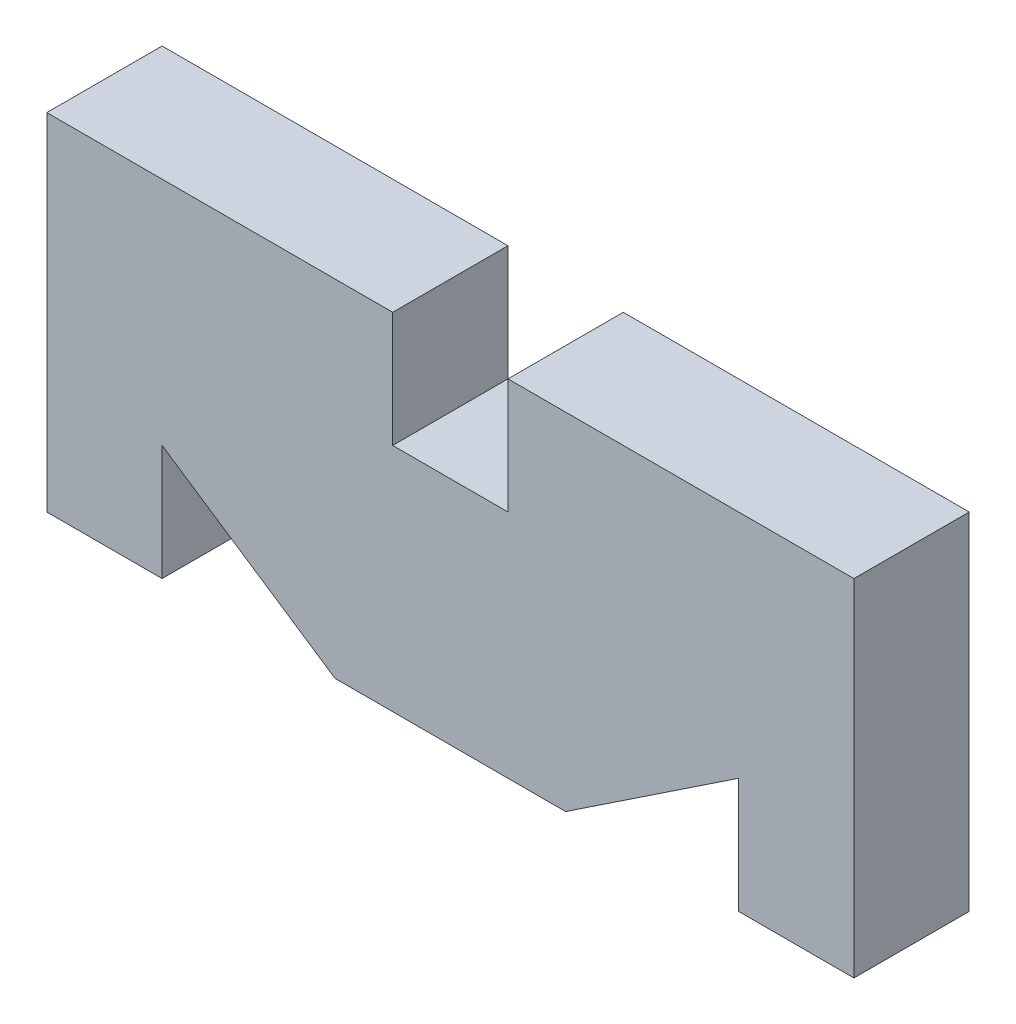
ISO-10303-21;
HEADER;
FILE_DESCRIPTION(('STEP AP214'),'2;1');
FILE_NAME('part.step','',(''),(''),'','','');
FILE_SCHEMA(('AUTOMOTIVE_DESIGN { 1 0 10303 214 1 1 1 1 }'));
ENDSEC;
DATA;
#1=APPLICATION_CONTEXT('core data for automotive mechanical design processes');
#2=APPLICATION_PROTOCOL_DEFINITION('international standard','automotive_design',2000,#1);
#3=PRODUCT_CONTEXT('',#1,'mechanical');
#4=PRODUCT('Part','Part','',(#3));
#5=PRODUCT_RELATED_PRODUCT_CATEGORY('part','',(#4));
#6=PRODUCT_DEFINITION_FORMATION('','',#4);
#7=PRODUCT_DEFINITION_CONTEXT('part definition',#1,'design');
#8=PRODUCT_DEFINITION('design','',#6,#7);
#9=PRODUCT_DEFINITION_SHAPE('','',#8);
#10=(LENGTH_UNIT() NAMED_UNIT(*) SI_UNIT(.MILLI.,.METRE.));
#11=(NAMED_UNIT(*) PLANE_ANGLE_UNIT() SI_UNIT($,.RADIAN.));
#12=(NAMED_UNIT(*) SI_UNIT($,.STERADIAN.) SOLID_ANGLE_UNIT());
#13=UNCERTAINTY_MEASURE_WITH_UNIT(LENGTH_MEASURE(1.E-05),#10,'distance_accuracy_value','');
#14=(GEOMETRIC_REPRESENTATION_CONTEXT(3) GLOBAL_UNCERTAINTY_ASSIGNED_CONTEXT((#13)) GLOBAL_UNIT_ASSIGNED_CONTEXT((#10,
#11,#12)) REPRESENTATION_CONTEXT('',''));
#15=CARTESIAN_POINT('',(0.,0.,0.));
#16=DIRECTION('',(0.,0.,1.));
#17=DIRECTION('',(1.,0.,0.));
#18=AXIS2_PLACEMENT_3D('',#15,#16,#17);
#19=CARTESIAN_POINT('',(0.,15.,10.));
#20=DIRECTION('',(0.,1.,0.));
#21=DIRECTION('',(0.,0.,1.));
#22=AXIS2_PLACEMENT_3D('',#19,#20,#21);
#23=PLANE('',#22);
#24=DIRECTION('',(1.,0.,0.));
#25=VECTOR('',#24,1.);
#26=CARTESIAN_POINT('',(0.,15.,0.));
#27=LINE('',#26,#25);
#28=CARTESIAN_POINT('',(5.,15.,0.));
#29=VERTEX_POINT('',#28);
#30=CARTESIAN_POINT('',(35.,15.,0.));
#31=VERTEX_POINT('',#30);
#32=EDGE_CURVE('E176',#29,#31,#27,.T.);
#33=ORIENTED_EDGE('',*,*,#32,.F.);
#34=DIRECTION('',(0.,0.,-1.));
#35=VECTOR('',#34,1.);
#36=CARTESIAN_POINT('',(5.,15.,10.));
#37=LINE('',#36,#35);
#38=CARTESIAN_POINT('',(5.,15.,10.));
#39=VERTEX_POINT('',#38);
#40=EDGE_CURVE('E11',#39,#29,#37,.T.);
#41=ORIENTED_EDGE('',*,*,#40,.F.);
#42=DIRECTION('',(1.,0.,0.));
#43=VECTOR('',#42,1.);
#44=CARTESIAN_POINT('',(0.,15.,10.));
#45=LINE('',#44,#43);
#46=CARTESIAN_POINT('',(35.,15.,10.));
#47=VERTEX_POINT('',#46);
#48=EDGE_CURVE('E226',#39,#47,#45,.T.);
#49=ORIENTED_EDGE('',*,*,#48,.T.);
#50=DIRECTION('',(0.,0.,-1.));
#51=VECTOR('',#50,1.);
#52=CARTESIAN_POINT('',(35.,15.,10.));
#53=LINE('',#52,#51);
#54=EDGE_CURVE('E113',#47,#31,#53,.T.);
#55=ORIENTED_EDGE('',*,*,#54,.T.);
#56=EDGE_LOOP('',(#33,#41,#49,#55));
#57=FACE_BOUND('',#56,.T.);
#58=ADVANCED_FACE('F43',(#57),#23,.T.);
#59=CARTESIAN_POINT('',(5.,0.,10.));
#60=DIRECTION('',(1.,0.,0.));
#61=DIRECTION('',(0.,1.,0.));
#62=AXIS2_PLACEMENT_3D('',#59,#60,#61);
#63=PLANE('',#62);
#64=DIRECTION('',(0.,-1.,0.));
#65=VECTOR('',#64,1.);
#66=CARTESIAN_POINT('',(5.,0.,0.));
#67=LINE('',#66,#65);
#68=CARTESIAN_POINT('',(5.,5.,0.));
#69=VERTEX_POINT('',#68);
#70=EDGE_CURVE('E180',#29,#69,#67,.T.);
#71=ORIENTED_EDGE('',*,*,#70,.T.);
#72=DIRECTION('',(0.,0.,-1.));
#73=VECTOR('',#72,1.);
#74=CARTESIAN_POINT('',(5.,5.,10.));
#75=LINE('',#74,#73);
#76=CARTESIAN_POINT('',(5.,5.,10.));
#77=VERTEX_POINT('',#76);
#78=EDGE_CURVE('E52',#77,#69,#75,.T.);
#79=ORIENTED_EDGE('',*,*,#78,.F.);
#80=DIRECTION('',(0.,-1.,0.));
#81=VECTOR('',#80,1.);
#82=CARTESIAN_POINT('',(5.,0.,10.));
#83=LINE('',#82,#81);
#84=EDGE_CURVE('E279',#39,#77,#83,.T.);
#85=ORIENTED_EDGE('',*,*,#84,.F.);
#86=ORIENTED_EDGE('',*,*,#40,.T.);
#87=EDGE_LOOP('',(#71,#79,#85,#86));
#88=FACE_BOUND('',#87,.T.);
#89=ADVANCED_FACE('F267',(#88),#63,.F.);
#90=CARTESIAN_POINT('',(0.,5.,10.));
#91=DIRECTION('',(0.,1.,0.));
#92=DIRECTION('',(0.,0.,1.));
#93=AXIS2_PLACEMENT_3D('',#90,#91,#92);
#94=PLANE('',#93);
#95=DIRECTION('',(1.,0.,0.));
#96=VECTOR('',#95,1.);
#97=CARTESIAN_POINT('',(0.,5.,0.));
#98=LINE('',#97,#96);
#99=CARTESIAN_POINT('',(-4.99999999999999,5.,0.));
#100=VERTEX_POINT('',#99);
#101=EDGE_CURVE('E184',#100,#69,#98,.T.);
#102=ORIENTED_EDGE('',*,*,#101,.F.);
#103=DIRECTION('',(0.,0.,-1.));
#104=VECTOR('',#103,1.);
#105=CARTESIAN_POINT('',(-4.99999999999999,5.,10.));
#106=LINE('',#105,#104);
#107=CARTESIAN_POINT('',(-4.99999999999999,5.,10.));
#108=VERTEX_POINT('',#107);
#109=EDGE_CURVE('E255',#108,#100,#106,.T.);
#110=ORIENTED_EDGE('',*,*,#109,.F.);
#111=DIRECTION('',(1.,0.,0.));
#112=VECTOR('',#111,1.);
#113=CARTESIAN_POINT('',(0.,5.,10.));
#114=LINE('',#113,#112);
#115=EDGE_CURVE('E264',#108,#77,#114,.T.);
#116=ORIENTED_EDGE('',*,*,#115,.T.);
#117=ORIENTED_EDGE('',*,*,#78,.T.);
#118=EDGE_LOOP('',(#102,#110,#116,#117));
#119=FACE_BOUND('',#118,.T.);
#120=ADVANCED_FACE('F262',(#119),#94,.T.);
#121=CARTESIAN_POINT('',(-4.99999999999999,0.,10.));
#122=DIRECTION('',(1.,0.,0.));
#123=DIRECTION('',(0.,0.,-1.));
#124=AXIS2_PLACEMENT_3D('',#121,#122,#123);
#125=PLANE('',#124);
#126=DIRECTION('',(0.,-1.,0.));
#127=VECTOR('',#126,1.);
#128=CARTESIAN_POINT('',(-4.99999999999999,0.,0.));
#129=LINE('',#128,#127);
#130=CARTESIAN_POINT('',(-4.99999999999999,15.,0.));
#131=VERTEX_POINT('',#130);
#132=EDGE_CURVE('E188',#131,#100,#129,.T.);
#133=ORIENTED_EDGE('',*,*,#132,.F.);
#134=DIRECTION('',(0.,0.,-1.));
#135=VECTOR('',#134,1.);
#136=CARTESIAN_POINT('',(-4.99999999999999,15.,10.));
#137=LINE('',#136,#135);
#138=CARTESIAN_POINT('',(-4.99999999999999,15.,10.));
#139=VERTEX_POINT('',#138);
#140=EDGE_CURVE('E252',#139,#131,#137,.T.);
#141=ORIENTED_EDGE('',*,*,#140,.F.);
#142=DIRECTION('',(0.,-1.,0.));
#143=VECTOR('',#142,1.);
#144=CARTESIAN_POINT('',(-4.99999999999999,0.,10.));
#145=LINE('',#144,#143);
#146=EDGE_CURVE('E276',#139,#108,#145,.T.);
#147=ORIENTED_EDGE('',*,*,#146,.T.);
#148=ORIENTED_EDGE('',*,*,#109,.T.);
#149=EDGE_LOOP('',(#133,#141,#147,#148));
#150=FACE_BOUND('',#149,.T.);
#151=ADVANCED_FACE('F273',(#150),#125,.T.);
#152=CARTESIAN_POINT('',(0.,15.,10.));
#153=DIRECTION('',(0.,1.,0.));
#154=DIRECTION('',(0.,0.,1.));
#155=AXIS2_PLACEMENT_3D('',#152,#153,#154);
#156=PLANE('',#155);
#157=DIRECTION('',(1.,0.,0.));
#158=VECTOR('',#157,1.);
#159=CARTESIAN_POINT('',(0.,15.,0.));
#160=LINE('',#159,#158);
#161=CARTESIAN_POINT('',(-35.,15.,0.));
#162=VERTEX_POINT('',#161);
#163=EDGE_CURVE('E192',#162,#131,#160,.T.);
#164=ORIENTED_EDGE('',*,*,#163,.F.);
#165=DIRECTION('',(0.,0.,-1.));
#166=VECTOR('',#165,1.);
#167=CARTESIAN_POINT('',(-35.,15.,10.));
#168=LINE('',#167,#166);
#169=CARTESIAN_POINT('',(-35.,15.,10.));
#170=VERTEX_POINT('',#169);
#171=EDGE_CURVE('E249',#170,#162,#168,.T.);
#172=ORIENTED_EDGE('',*,*,#171,.F.);
#173=DIRECTION('',(1.,0.,0.));
#174=VECTOR('',#173,1.);
#175=CARTESIAN_POINT('',(0.,15.,10.));
#176=LINE('',#175,#174);
#177=EDGE_CURVE('E284',#170,#139,#176,.T.);
#178=ORIENTED_EDGE('',*,*,#177,.T.);
#179=ORIENTED_EDGE('',*,*,#140,.T.);
#180=EDGE_LOOP('',(#164,#172,#178,#179));
#181=FACE_BOUND('',#180,.T.);
#182=ADVANCED_FACE('F328',(#181),#156,.T.);
#183=CARTESIAN_POINT('',(-35.,0.,10.));
#184=DIRECTION('',(-1.,0.,0.));
#185=DIRECTION('',(0.,0.,1.));
#186=AXIS2_PLACEMENT_3D('',#183,#184,#185);
#187=PLANE('',#186);
#188=DIRECTION('',(0.,1.,0.));
#189=VECTOR('',#188,1.);
#190=CARTESIAN_POINT('',(-35.,0.,0.));
#191=LINE('',#190,#189);
#192=CARTESIAN_POINT('',(-35.,-15.,0.));
#193=VERTEX_POINT('',#192);
#194=EDGE_CURVE('E196',#193,#162,#191,.T.);
#195=ORIENTED_EDGE('',*,*,#194,.F.);
#196=DIRECTION('',(0.,0.,-1.));
#197=VECTOR('',#196,1.);
#198=CARTESIAN_POINT('',(-35.,-15.,10.));
#199=LINE('',#198,#197);
#200=CARTESIAN_POINT('',(-35.,-15.,10.));
#201=VERTEX_POINT('',#200);
#202=EDGE_CURVE('E246',#201,#193,#199,.T.);
#203=ORIENTED_EDGE('',*,*,#202,.F.);
#204=DIRECTION('',(0.,1.,0.));
#205=VECTOR('',#204,1.);
#206=CARTESIAN_POINT('',(-35.,0.,10.));
#207=LINE('',#206,#205);
#208=EDGE_CURVE('E291',#201,#170,#207,.T.);
#209=ORIENTED_EDGE('',*,*,#208,.T.);
#210=ORIENTED_EDGE('',*,*,#171,.T.);
#211=EDGE_LOOP('',(#195,#203,#209,#210));
#212=FACE_BOUND('',#211,.T.);
#213=ADVANCED_FACE('F331',(#212),#187,.T.);
#214=CARTESIAN_POINT('',(0.,-15.,10.));
#215=DIRECTION('',(0.,1.,0.));
#216=DIRECTION('',(0.,0.,1.));
#217=AXIS2_PLACEMENT_3D('',#214,#215,#216);
#218=PLANE('',#217);
#219=DIRECTION('',(1.,0.,0.));
#220=VECTOR('',#219,1.);
#221=CARTESIAN_POINT('',(0.,-15.,0.));
#222=LINE('',#221,#220);
#223=CARTESIAN_POINT('',(-25.,-15.,0.));
#224=VERTEX_POINT('',#223);
#225=EDGE_CURVE('E200',#193,#224,#222,.T.);
#226=ORIENTED_EDGE('',*,*,#225,.T.);
#227=DIRECTION('',(0.,0.,-1.));
#228=VECTOR('',#227,1.);
#229=CARTESIAN_POINT('',(-25.,-15.,10.));
#230=LINE('',#229,#228);
#231=CARTESIAN_POINT('',(-25.,-15.,10.));
#232=VERTEX_POINT('',#231);
#233=EDGE_CURVE('E243',#232,#224,#230,.T.);
#234=ORIENTED_EDGE('',*,*,#233,.F.);
#235=DIRECTION('',(1.,0.,0.));
#236=VECTOR('',#235,1.);
#237=CARTESIAN_POINT('',(0.,-15.,10.));
#238=LINE('',#237,#236);
#239=EDGE_CURVE('E295',#201,#232,#238,.T.);
#240=ORIENTED_EDGE('',*,*,#239,.F.);
#241=ORIENTED_EDGE('',*,*,#202,.T.);
#242=EDGE_LOOP('',(#226,#234,#240,#241));
#243=FACE_BOUND('',#242,.T.);
#244=ADVANCED_FACE('F335',(#243),#218,.F.);
#245=CARTESIAN_POINT('',(-25.,0.,10.));
#246=DIRECTION('',(1.,0.,0.));
#247=DIRECTION('',(0.,0.,-1.));
#248=AXIS2_PLACEMENT_3D('',#245,#246,#247);
#249=PLANE('',#248);
#250=DIRECTION('',(0.,-1.,0.));
#251=VECTOR('',#250,1.);
#252=CARTESIAN_POINT('',(-25.,0.,0.));
#253=LINE('',#252,#251);
#254=CARTESIAN_POINT('',(-25.,-4.99999999999999,0.));
#255=VERTEX_POINT('',#254);
#256=EDGE_CURVE('E204',#255,#224,#253,.T.);
#257=ORIENTED_EDGE('',*,*,#256,.F.);
#258=DIRECTION('',(0.,0.,-1.));
#259=VECTOR('',#258,1.);
#260=CARTESIAN_POINT('',(-25.,-4.99999999999999,10.));
#261=LINE('',#260,#259);
#262=CARTESIAN_POINT('',(-25.,-4.99999999999999,10.));
#263=VERTEX_POINT('',#262);
#264=EDGE_CURVE('E240',#263,#255,#261,.T.);
#265=ORIENTED_EDGE('',*,*,#264,.F.);
#266=DIRECTION('',(0.,-1.,0.));
#267=VECTOR('',#266,1.);
#268=CARTESIAN_POINT('',(-25.,0.,10.));
#269=LINE('',#268,#267);
#270=EDGE_CURVE('E298',#263,#232,#269,.T.);
#271=ORIENTED_EDGE('',*,*,#270,.T.);
#272=ORIENTED_EDGE('',*,*,#233,.T.);
#273=EDGE_LOOP('',(#257,#265,#271,#272));
#274=FACE_BOUND('',#273,.T.);
#275=ADVANCED_FACE('F339',(#274),#249,.T.);
#276=CARTESIAN_POINT('',(-10.,-15.,10.));
#277=DIRECTION('',(0.554700196225229,0.832050294337844,0.));
#278=DIRECTION('',(-0.832050294337844,0.554700196225229,0.));
#279=AXIS2_PLACEMENT_3D('',#276,#277,#278);
#280=PLANE('',#279);
#281=DIRECTION('',(0.832050294337844,-0.554700196225229,0.));
#282=VECTOR('',#281,1.);
#283=CARTESIAN_POINT('',(-10.,-15.,0.));
#284=LINE('',#283,#282);
#285=CARTESIAN_POINT('',(-9.99999999999998,-15.,0.));
#286=VERTEX_POINT('',#285);
#287=EDGE_CURVE('E208',#255,#286,#284,.T.);
#288=ORIENTED_EDGE('',*,*,#287,.T.);
#289=DIRECTION('',(0.,0.,-1.));
#290=VECTOR('',#289,1.);
#291=CARTESIAN_POINT('',(-9.99999999999998,-15.,10.));
#292=LINE('',#291,#290);
#293=CARTESIAN_POINT('',(-9.99999999999998,-15.,10.));
#294=VERTEX_POINT('',#293);
#295=EDGE_CURVE('E236',#294,#286,#292,.T.);
#296=ORIENTED_EDGE('',*,*,#295,.F.);
#297=DIRECTION('',(0.832050294337844,-0.554700196225229,0.));
#298=VECTOR('',#297,1.);
#299=CARTESIAN_POINT('',(-10.,-15.,10.));
#300=LINE('',#299,#298);
#301=EDGE_CURVE('E302',#263,#294,#300,.T.);
#302=ORIENTED_EDGE('',*,*,#301,.F.);
#303=ORIENTED_EDGE('',*,*,#264,.T.);
#304=EDGE_LOOP('',(#288,#296,#302,#303));
#305=FACE_BOUND('',#304,.T.);
#306=ADVANCED_FACE('F343',(#305),#280,.F.);
#307=CARTESIAN_POINT('',(0.,-15.,10.));
#308=DIRECTION('',(0.,1.,0.));
#309=DIRECTION('',(0.,0.,1.));
#310=AXIS2_PLACEMENT_3D('',#307,#308,#309);
#311=PLANE('',#310);
#312=DIRECTION('',(1.,0.,0.));
#313=VECTOR('',#312,1.);
#314=CARTESIAN_POINT('',(0.,-15.,0.));
#315=LINE('',#314,#313);
#316=CARTESIAN_POINT('',(10.,-15.,0.));
#317=VERTEX_POINT('',#316);
#318=EDGE_CURVE('E211',#286,#317,#315,.T.);
#319=ORIENTED_EDGE('',*,*,#318,.T.);
#320=DIRECTION('',(0.,0.,-1.));
#321=VECTOR('',#320,1.);
#322=CARTESIAN_POINT('',(10.,-15.,10.));
#323=LINE('',#322,#321);
#324=CARTESIAN_POINT('',(10.,-15.,10.));
#325=VERTEX_POINT('',#324);
#326=EDGE_CURVE('E233',#325,#317,#323,.T.);
#327=ORIENTED_EDGE('',*,*,#326,.F.);
#328=DIRECTION('',(1.,0.,0.));
#329=VECTOR('',#328,1.);
#330=CARTESIAN_POINT('',(0.,-15.,10.));
#331=LINE('',#330,#329);
#332=EDGE_CURVE('E305',#294,#325,#331,.T.);
#333=ORIENTED_EDGE('',*,*,#332,.F.);
#334=ORIENTED_EDGE('',*,*,#295,.T.);
#335=EDGE_LOOP('',(#319,#327,#333,#334));
#336=FACE_BOUND('',#335,.T.);
#337=ADVANCED_FACE('F347',(#336),#311,.F.);
#338=CARTESIAN_POINT('',(10.,-15.,10.));
#339=DIRECTION('',(0.554700196225229,-0.832050294337843,0.));
#340=DIRECTION('',(0.832050294337843,0.554700196225229,0.));
#341=AXIS2_PLACEMENT_3D('',#338,#339,#340);
#342=PLANE('',#341);
#343=DIRECTION('',(-0.832050294337844,-0.554700196225229,0.));
#344=VECTOR('',#343,1.);
#345=CARTESIAN_POINT('',(10.,-15.,0.));
#346=LINE('',#345,#344);
#347=CARTESIAN_POINT('',(25.,-5.,0.));
#348=VERTEX_POINT('',#347);
#349=EDGE_CURVE('E215',#348,#317,#346,.T.);
#350=ORIENTED_EDGE('',*,*,#349,.F.);
#351=DIRECTION('',(0.,0.,-1.));
#352=VECTOR('',#351,1.);
#353=CARTESIAN_POINT('',(25.,-5.,10.));
#354=LINE('',#353,#352);
#355=CARTESIAN_POINT('',(25.,-5.,10.));
#356=VERTEX_POINT('',#355);
#357=EDGE_CURVE('E166',#356,#348,#354,.T.);
#358=ORIENTED_EDGE('',*,*,#357,.F.);
#359=DIRECTION('',(-0.832050294337844,-0.554700196225229,0.));
#360=VECTOR('',#359,1.);
#361=CARTESIAN_POINT('',(10.,-15.,10.));
#362=LINE('',#361,#360);
#363=EDGE_CURVE('E157',#356,#325,#362,.T.);
#364=ORIENTED_EDGE('',*,*,#363,.T.);
#365=ORIENTED_EDGE('',*,*,#326,.T.);
#366=EDGE_LOOP('',(#350,#358,#364,#365));
#367=FACE_BOUND('',#366,.T.);
#368=ADVANCED_FACE('F310',(#367),#342,.T.);
#369=CARTESIAN_POINT('',(25.,0.,10.));
#370=DIRECTION('',(1.,0.,0.));
#371=DIRECTION('',(0.,1.,0.));
#372=AXIS2_PLACEMENT_3D('',#369,#370,#371);
#373=PLANE('',#372);
#374=DIRECTION('',(0.,-1.,0.));
#375=VECTOR('',#374,1.);
#376=CARTESIAN_POINT('',(25.,0.,0.));
#377=LINE('',#376,#375);
#378=CARTESIAN_POINT('',(25.,-15.,0.));
#379=VERTEX_POINT('',#378);
#380=EDGE_CURVE('E164',#348,#379,#377,.T.);
#381=ORIENTED_EDGE('',*,*,#380,.T.);
#382=DIRECTION('',(0.,0.,-1.));
#383=VECTOR('',#382,1.);
#384=CARTESIAN_POINT('',(25.,-15.,10.));
#385=LINE('',#384,#383);
#386=CARTESIAN_POINT('',(25.,-15.,10.));
#387=VERTEX_POINT('',#386);
#388=EDGE_CURVE('E161',#387,#379,#385,.T.);
#389=ORIENTED_EDGE('',*,*,#388,.F.);
#390=DIRECTION('',(0.,-1.,0.));
#391=VECTOR('',#390,1.);
#392=CARTESIAN_POINT('',(25.,0.,10.));
#393=LINE('',#392,#391);
#394=EDGE_CURVE('E151',#356,#387,#393,.T.);
#395=ORIENTED_EDGE('',*,*,#394,.F.);
#396=ORIENTED_EDGE('',*,*,#357,.T.);
#397=EDGE_LOOP('',(#381,#389,#395,#396));
#398=FACE_BOUND('',#397,.T.);
#399=ADVANCED_FACE('F162',(#398),#373,.F.);
#400=CARTESIAN_POINT('',(0.,-15.,10.));
#401=DIRECTION('',(0.,1.,0.));
#402=DIRECTION('',(0.,0.,1.));
#403=AXIS2_PLACEMENT_3D('',#400,#401,#402);
#404=PLANE('',#403);
#405=DIRECTION('',(1.,0.,0.));
#406=VECTOR('',#405,1.);
#407=CARTESIAN_POINT('',(0.,-15.,0.));
#408=LINE('',#407,#406);
#409=CARTESIAN_POINT('',(35.,-15.,0.));
#410=VERTEX_POINT('',#409);
#411=EDGE_CURVE('E106',#379,#410,#408,.T.);
#412=ORIENTED_EDGE('',*,*,#411,.T.);
#413=DIRECTION('',(0.,0.,-1.));
#414=VECTOR('',#413,1.);
#415=CARTESIAN_POINT('',(35.,-15.,10.));
#416=LINE('',#415,#414);
#417=CARTESIAN_POINT('',(35.,-15.,10.));
#418=VERTEX_POINT('',#417);
#419=EDGE_CURVE('E167',#418,#410,#416,.T.);
#420=ORIENTED_EDGE('',*,*,#419,.F.);
#421=DIRECTION('',(1.,0.,0.));
#422=VECTOR('',#421,1.);
#423=CARTESIAN_POINT('',(0.,-15.,10.));
#424=LINE('',#423,#422);
#425=EDGE_CURVE('E155',#387,#418,#424,.T.);
#426=ORIENTED_EDGE('',*,*,#425,.F.);
#427=ORIENTED_EDGE('',*,*,#388,.T.);
#428=EDGE_LOOP('',(#412,#420,#426,#427));
#429=FACE_BOUND('',#428,.T.);
#430=ADVANCED_FACE('F169',(#429),#404,.F.);
#431=CARTESIAN_POINT('',(35.,0.,10.));
#432=DIRECTION('',(-1.,0.,0.));
#433=DIRECTION('',(0.,0.,1.));
#434=AXIS2_PLACEMENT_3D('',#431,#432,#433);
#435=PLANE('',#434);
#436=DIRECTION('',(0.,1.,0.));
#437=VECTOR('',#436,1.);
#438=CARTESIAN_POINT('',(35.,0.,0.));
#439=LINE('',#438,#437);
#440=EDGE_CURVE('E223',#410,#31,#439,.T.);
#441=ORIENTED_EDGE('',*,*,#440,.T.);
#442=ORIENTED_EDGE('',*,*,#54,.F.);
#443=DIRECTION('',(0.,1.,0.));
#444=VECTOR('',#443,1.);
#445=CARTESIAN_POINT('',(35.,0.,10.));
#446=LINE('',#445,#444);
#447=EDGE_CURVE('E60',#418,#47,#446,.T.);
#448=ORIENTED_EDGE('',*,*,#447,.F.);
#449=ORIENTED_EDGE('',*,*,#419,.T.);
#450=EDGE_LOOP('',(#441,#442,#448,#449));
#451=FACE_BOUND('',#450,.T.);
#452=ADVANCED_FACE('F315',(#451),#435,.F.);
#453=CARTESIAN_POINT('',(0.,0.,10.));
#454=DIRECTION('',(0.,0.,1.));
#455=DIRECTION('',(1.,0.,0.));
#456=AXIS2_PLACEMENT_3D('',#453,#454,#455);
#457=PLANE('',#456);
#458=ORIENTED_EDGE('',*,*,#48,.F.);
#459=ORIENTED_EDGE('',*,*,#84,.T.);
#460=ORIENTED_EDGE('',*,*,#115,.F.);
#461=ORIENTED_EDGE('',*,*,#146,.F.);
#462=ORIENTED_EDGE('',*,*,#177,.F.);
#463=ORIENTED_EDGE('',*,*,#208,.F.);
#464=ORIENTED_EDGE('',*,*,#239,.T.);
#465=ORIENTED_EDGE('',*,*,#270,.F.);
#466=ORIENTED_EDGE('',*,*,#301,.T.);
#467=ORIENTED_EDGE('',*,*,#332,.T.);
#468=ORIENTED_EDGE('',*,*,#363,.F.);
#469=ORIENTED_EDGE('',*,*,#394,.T.);
#470=ORIENTED_EDGE('',*,*,#425,.T.);
#471=ORIENTED_EDGE('',*,*,#447,.T.);
#472=EDGE_LOOP('',(#458,#459,#460,#461,#462,#463,#464,#465,#466,#467,#468,#469,#470,#471));
#473=FACE_BOUND('',#472,.T.);
#474=ADVANCED_FACE('F153',(#473),#457,.T.);
#475=CARTESIAN_POINT('',(0.,0.,0.));
#476=DIRECTION('',(0.,0.,1.));
#477=DIRECTION('',(1.,0.,0.));
#478=AXIS2_PLACEMENT_3D('',#475,#476,#477);
#479=PLANE('',#478);
#480=ORIENTED_EDGE('',*,*,#32,.T.);
#481=ORIENTED_EDGE('',*,*,#440,.F.);
#482=ORIENTED_EDGE('',*,*,#411,.F.);
#483=ORIENTED_EDGE('',*,*,#380,.F.);
#484=ORIENTED_EDGE('',*,*,#349,.T.);
#485=ORIENTED_EDGE('',*,*,#318,.F.);
#486=ORIENTED_EDGE('',*,*,#287,.F.);
#487=ORIENTED_EDGE('',*,*,#256,.T.);
#488=ORIENTED_EDGE('',*,*,#225,.F.);
#489=ORIENTED_EDGE('',*,*,#194,.T.);
#490=ORIENTED_EDGE('',*,*,#163,.T.);
#491=ORIENTED_EDGE('',*,*,#132,.T.);
#492=ORIENTED_EDGE('',*,*,#101,.T.);
#493=ORIENTED_EDGE('',*,*,#70,.F.);
#494=EDGE_LOOP('',(#480,#481,#482,#483,#484,#485,#486,#487,#488,#489,#490,#491,#492,#493));
#495=FACE_BOUND('',#494,.T.);
#496=ADVANCED_FACE('F269',(#495),#479,.F.);
#497=CLOSED_SHELL('',(#58,#89,#120,#151,#182,#213,#244,#275,#306,#337,#368,#399,#430,#452,#474,#496));
#498=MANIFOLD_SOLID_BREP('B2',#497);
#499=ADVANCED_BREP_SHAPE_REPRESENTATION('',(#18,#498),#14);
#500=SHAPE_DEFINITION_REPRESENTATION(#9,#499);
ENDSEC;
END-ISO-10303-21;
